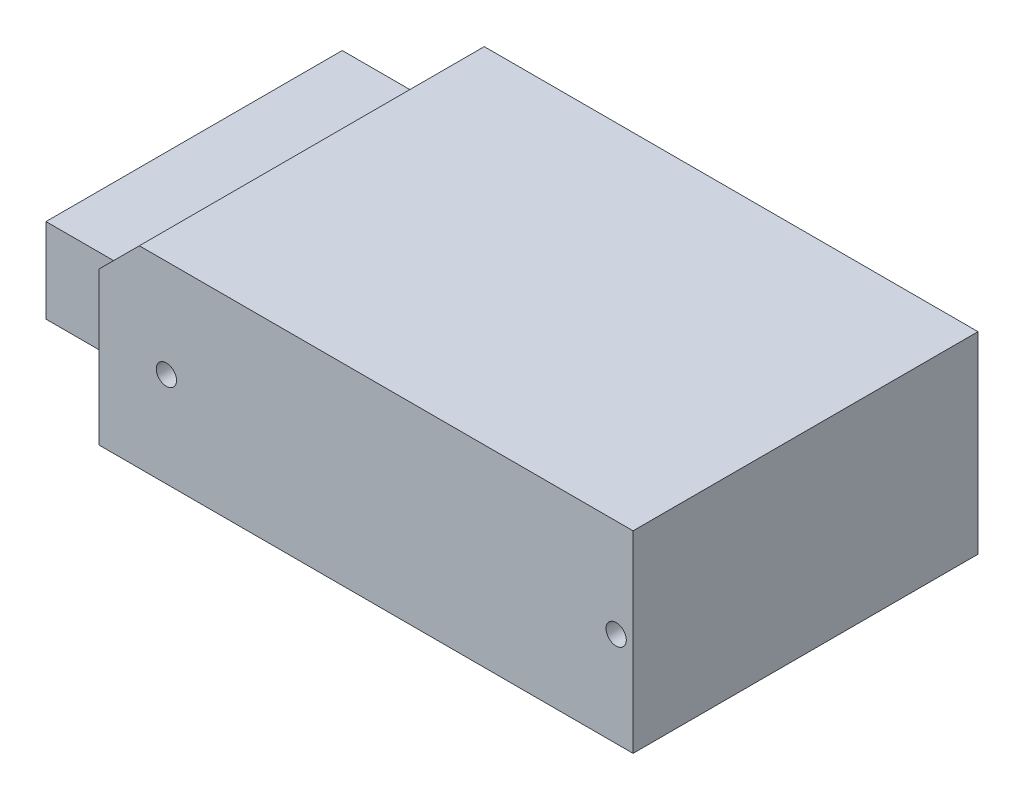
ISO-10303-21;
HEADER;
FILE_DESCRIPTION(('STEP AP214'),'2;1');
FILE_NAME('part.step','',(''),(''),'','','');
FILE_SCHEMA(('AUTOMOTIVE_DESIGN { 1 0 10303 214 1 1 1 1 }'));
ENDSEC;
DATA;
#1=APPLICATION_CONTEXT('core data for automotive mechanical design processes');
#2=APPLICATION_PROTOCOL_DEFINITION('international standard','automotive_design',2000,#1);
#3=PRODUCT_CONTEXT('',#1,'mechanical');
#4=PRODUCT('Part','Part','',(#3));
#5=PRODUCT_RELATED_PRODUCT_CATEGORY('part','',(#4));
#6=PRODUCT_DEFINITION_FORMATION('','',#4);
#7=PRODUCT_DEFINITION_CONTEXT('part definition',#1,'design');
#8=PRODUCT_DEFINITION('design','',#6,#7);
#9=PRODUCT_DEFINITION_SHAPE('','',#8);
#10=(LENGTH_UNIT() NAMED_UNIT(*) SI_UNIT(.MILLI.,.METRE.));
#11=(NAMED_UNIT(*) PLANE_ANGLE_UNIT() SI_UNIT($,.RADIAN.));
#12=(NAMED_UNIT(*) SI_UNIT($,.STERADIAN.) SOLID_ANGLE_UNIT());
#13=UNCERTAINTY_MEASURE_WITH_UNIT(LENGTH_MEASURE(1.E-05),#10,'distance_accuracy_value','');
#14=(GEOMETRIC_REPRESENTATION_CONTEXT(3) GLOBAL_UNCERTAINTY_ASSIGNED_CONTEXT((#13)) GLOBAL_UNIT_ASSIGNED_CONTEXT((#10,
#11,#12)) REPRESENTATION_CONTEXT('',''));
#15=CARTESIAN_POINT('',(0.,0.,0.));
#16=DIRECTION('',(0.,0.,1.));
#17=DIRECTION('',(1.,0.,0.));
#18=AXIS2_PLACEMENT_3D('',#15,#16,#17);
#19=CARTESIAN_POINT('',(-39.5,28.5,25.5));
#20=DIRECTION('',(1.,0.,0.));
#21=DIRECTION('',(0.,0.,-1.));
#22=AXIS2_PLACEMENT_3D('',#19,#20,#21);
#23=PLANE('',#22);
#24=DIRECTION('',(0.,-1.,0.));
#25=VECTOR('',#24,1.);
#26=CARTESIAN_POINT('',(-39.5,28.5,25.5));
#27=LINE('',#26,#25);
#28=CARTESIAN_POINT('',(-39.5,22.5,25.5));
#29=VERTEX_POINT('',#28);
#30=CARTESIAN_POINT('',(-39.5,0.,25.5));
#31=VERTEX_POINT('',#30);
#32=EDGE_CURVE('E113',#29,#31,#27,.T.);
#33=ORIENTED_EDGE('',*,*,#32,.F.);
#34=DIRECTION('',(0.,0.,1.));
#35=VECTOR('',#34,1.);
#36=CARTESIAN_POINT('',(-39.5,22.5,-25.50005));
#37=LINE('',#36,#35);
#38=CARTESIAN_POINT('',(-39.5,22.5,-25.5));
#39=VERTEX_POINT('',#38);
#40=EDGE_CURVE('E103',#39,#29,#37,.T.);
#41=ORIENTED_EDGE('',*,*,#40,.F.);
#42=DIRECTION('',(0.,-1.,0.));
#43=VECTOR('',#42,1.);
#44=CARTESIAN_POINT('',(-39.5,28.5,-25.5));
#45=LINE('',#44,#43);
#46=CARTESIAN_POINT('',(-39.5,17.5,-25.5));
#47=VERTEX_POINT('',#46);
#48=EDGE_CURVE('E37',#39,#47,#45,.T.);
#49=ORIENTED_EDGE('',*,*,#48,.T.);
#50=DIRECTION('',(0.,0.,-1.));
#51=VECTOR('',#50,1.);
#52=CARTESIAN_POINT('',(-39.5,17.5,-25.5));
#53=LINE('',#52,#51);
#54=CARTESIAN_POINT('',(-39.5,17.5,18.3));
#55=VERTEX_POINT('',#54);
#56=EDGE_CURVE('E57',#55,#47,#53,.T.);
#57=ORIENTED_EDGE('',*,*,#56,.F.);
#58=DIRECTION('',(0.,1.,0.));
#59=VECTOR('',#58,1.);
#60=CARTESIAN_POINT('',(-39.5,17.5,18.3));
#61=LINE('',#60,#59);
#62=CARTESIAN_POINT('',(-39.5,5.,18.3));
#63=VERTEX_POINT('',#62);
#64=EDGE_CURVE('E136',#63,#55,#61,.T.);
#65=ORIENTED_EDGE('',*,*,#64,.F.);
#66=DIRECTION('',(0.,0.,1.));
#67=VECTOR('',#66,1.);
#68=CARTESIAN_POINT('',(-39.5,5.,-25.5));
#69=LINE('',#68,#67);
#70=CARTESIAN_POINT('',(-39.5,5.00000000000002,-25.5));
#71=VERTEX_POINT('',#70);
#72=EDGE_CURVE('E133',#71,#63,#69,.T.);
#73=ORIENTED_EDGE('',*,*,#72,.F.);
#74=CARTESIAN_POINT('',(-39.5,0.,-25.5));
#75=VERTEX_POINT('',#74);
#76=EDGE_CURVE('E122',#71,#75,#45,.T.);
#77=ORIENTED_EDGE('',*,*,#76,.T.);
#78=DIRECTION('',(0.,0.,1.));
#79=VECTOR('',#78,1.);
#80=CARTESIAN_POINT('',(-39.5,0.,25.5));
#81=LINE('',#80,#79);
#82=EDGE_CURVE('E120',#75,#31,#81,.T.);
#83=ORIENTED_EDGE('',*,*,#82,.T.);
#84=EDGE_LOOP('',(#33,#41,#49,#57,#65,#73,#77,#83));
#85=FACE_BOUND('',#84,.T.);
#86=ADVANCED_FACE('F33',(#85),#23,.F.);
#87=CARTESIAN_POINT('',(39.5,28.5,25.5));
#88=DIRECTION('',(-1.,0.,0.));
#89=DIRECTION('',(0.,0.,1.));
#90=AXIS2_PLACEMENT_3D('',#87,#88,#89);
#91=PLANE('',#90);
#92=DIRECTION('',(0.,0.,-1.));
#93=VECTOR('',#92,1.);
#94=CARTESIAN_POINT('',(39.5,0.,25.5));
#95=LINE('',#94,#93);
#96=CARTESIAN_POINT('',(39.5,0.,25.5));
#97=VERTEX_POINT('',#96);
#98=CARTESIAN_POINT('',(39.5,0.,-25.5));
#99=VERTEX_POINT('',#98);
#100=EDGE_CURVE('E142',#97,#99,#95,.T.);
#101=ORIENTED_EDGE('',*,*,#100,.T.);
#102=DIRECTION('',(0.,-1.,0.));
#103=VECTOR('',#102,1.);
#104=CARTESIAN_POINT('',(39.5,28.5,-25.5));
#105=LINE('',#104,#103);
#106=CARTESIAN_POINT('',(39.5,28.5,-25.5));
#107=VERTEX_POINT('',#106);
#108=EDGE_CURVE('E43',#107,#99,#105,.T.);
#109=ORIENTED_EDGE('',*,*,#108,.F.);
#110=DIRECTION('',(0.,0.,-1.));
#111=VECTOR('',#110,1.);
#112=CARTESIAN_POINT('',(39.5,28.5,25.5));
#113=LINE('',#112,#111);
#114=CARTESIAN_POINT('',(39.5,28.5,25.5));
#115=VERTEX_POINT('',#114);
#116=EDGE_CURVE('E160',#115,#107,#113,.T.);
#117=ORIENTED_EDGE('',*,*,#116,.F.);
#118=DIRECTION('',(0.,-1.,0.));
#119=VECTOR('',#118,1.);
#120=CARTESIAN_POINT('',(39.5,28.5,25.5));
#121=LINE('',#120,#119);
#122=EDGE_CURVE('E123',#115,#97,#121,.T.);
#123=ORIENTED_EDGE('',*,*,#122,.T.);
#124=EDGE_LOOP('',(#101,#109,#117,#123));
#125=FACE_BOUND('',#124,.T.);
#126=ADVANCED_FACE('F35',(#125),#91,.F.);
#127=CARTESIAN_POINT('',(-39.5,28.5,-25.5));
#128=DIRECTION('',(0.,0.,1.));
#129=DIRECTION('',(1.,0.,0.));
#130=AXIS2_PLACEMENT_3D('',#127,#128,#129);
#131=PLANE('',#130);
#132=ORIENTED_EDGE('',*,*,#48,.F.);
#133=DIRECTION('',(0.707106781186547,0.707106781186548,0.));
#134=VECTOR('',#133,1.);
#135=CARTESIAN_POINT('',(-36.5,25.5,-25.5));
#136=LINE('',#135,#134);
#137=CARTESIAN_POINT('',(-33.5,28.5,-25.5));
#138=VERTEX_POINT('',#137);
#139=EDGE_CURVE('E106',#39,#138,#136,.T.);
#140=ORIENTED_EDGE('',*,*,#139,.T.);
#141=DIRECTION('',(-1.,0.,0.));
#142=VECTOR('',#141,1.);
#143=CARTESIAN_POINT('',(-39.5,28.5,-25.5));
#144=LINE('',#143,#142);
#145=EDGE_CURVE('E163',#107,#138,#144,.T.);
#146=ORIENTED_EDGE('',*,*,#145,.F.);
#147=ORIENTED_EDGE('',*,*,#108,.T.);
#148=DIRECTION('',(-1.,0.,0.));
#149=VECTOR('',#148,1.);
#150=CARTESIAN_POINT('',(-39.5,0.,-25.5));
#151=LINE('',#150,#149);
#152=EDGE_CURVE('E170',#99,#75,#151,.T.);
#153=ORIENTED_EDGE('',*,*,#152,.T.);
#154=ORIENTED_EDGE('',*,*,#76,.F.);
#155=DIRECTION('',(1.,0.,0.));
#156=VECTOR('',#155,1.);
#157=CARTESIAN_POINT('',(-54.5,5.,-25.5));
#158=LINE('',#157,#156);
#159=CARTESIAN_POINT('',(-54.5,5.,-25.5));
#160=VERTEX_POINT('',#159);
#161=EDGE_CURVE('E139',#160,#71,#158,.T.);
#162=ORIENTED_EDGE('',*,*,#161,.F.);
#163=DIRECTION('',(0.,-1.,0.));
#164=VECTOR('',#163,1.);
#165=CARTESIAN_POINT('',(-54.5,17.5,-25.5));
#166=LINE('',#165,#164);
#167=CARTESIAN_POINT('',(-54.5,17.5,-25.5));
#168=VERTEX_POINT('',#167);
#169=EDGE_CURVE('E148',#168,#160,#166,.T.);
#170=ORIENTED_EDGE('',*,*,#169,.F.);
#171=DIRECTION('',(1.,0.,0.));
#172=VECTOR('',#171,1.);
#173=CARTESIAN_POINT('',(-54.5,17.5,-25.5));
#174=LINE('',#173,#172);
#175=EDGE_CURVE('E149',#168,#47,#174,.T.);
#176=ORIENTED_EDGE('',*,*,#175,.T.);
#177=EDGE_LOOP('',(#132,#140,#146,#147,#153,#154,#162,#170,#176));
#178=FACE_BOUND('',#177,.T.);
#179=ADVANCED_FACE('F182',(#178),#131,.F.);
#180=CARTESIAN_POINT('',(-39.5,28.5,25.5));
#181=DIRECTION('',(0.,0.,-1.));
#182=DIRECTION('',(-1.,0.,0.));
#183=AXIS2_PLACEMENT_3D('',#180,#181,#182);
#184=PLANE('',#183);
#185=CARTESIAN_POINT('',(37.,14.,25.5));
#186=DIRECTION('',(0.,0.,1.));
#187=DIRECTION('',(1.,0.,0.));
#188=AXIS2_PLACEMENT_3D('',#185,#186,#187);
#189=CIRCLE('',#188,1.5);
#190=CARTESIAN_POINT('',(38.5,14.,25.5));
#191=VERTEX_POINT('',#190);
#192=EDGE_CURVE('E207',#191,#191,#189,.T.);
#193=ORIENTED_EDGE('',*,*,#192,.F.);
#194=EDGE_LOOP('',(#193));
#195=FACE_BOUND('',#194,.T.);
#196=CARTESIAN_POINT('',(-29.5,14.,25.5));
#197=DIRECTION('',(0.,0.,1.));
#198=DIRECTION('',(1.,0.,0.));
#199=AXIS2_PLACEMENT_3D('',#196,#197,#198);
#200=CIRCLE('',#199,1.5);
#201=CARTESIAN_POINT('',(-28.,14.,25.5));
#202=VERTEX_POINT('',#201);
#203=EDGE_CURVE('E201',#202,#202,#200,.T.);
#204=ORIENTED_EDGE('',*,*,#203,.F.);
#205=EDGE_LOOP('',(#204));
#206=FACE_BOUND('',#205,.T.);
#207=DIRECTION('',(1.,0.,0.));
#208=VECTOR('',#207,1.);
#209=CARTESIAN_POINT('',(-39.5,28.5,25.5));
#210=LINE('',#209,#208);
#211=CARTESIAN_POINT('',(-33.5,28.5,25.5));
#212=VERTEX_POINT('',#211);
#213=EDGE_CURVE('E116',#212,#115,#210,.T.);
#214=ORIENTED_EDGE('',*,*,#213,.F.);
#215=DIRECTION('',(0.707106781186547,0.707106781186548,0.));
#216=VECTOR('',#215,1.);
#217=CARTESIAN_POINT('',(-39.5,22.5,25.5));
#218=LINE('',#217,#216);
#219=EDGE_CURVE('E50',#29,#212,#218,.T.);
#220=ORIENTED_EDGE('',*,*,#219,.F.);
#221=ORIENTED_EDGE('',*,*,#32,.T.);
#222=DIRECTION('',(1.,0.,0.));
#223=VECTOR('',#222,1.);
#224=CARTESIAN_POINT('',(-39.5,0.,25.5));
#225=LINE('',#224,#223);
#226=EDGE_CURVE('E164',#31,#97,#225,.T.);
#227=ORIENTED_EDGE('',*,*,#226,.T.);
#228=ORIENTED_EDGE('',*,*,#122,.F.);
#229=EDGE_LOOP('',(#214,#220,#221,#227,#228));
#230=FACE_BOUND('',#229,.T.);
#231=ADVANCED_FACE('F112',(#195,#206,#230),#184,.F.);
#232=CARTESIAN_POINT('',(39.5,28.5,-25.5));
#233=DIRECTION('',(0.,-1.,0.));
#234=DIRECTION('',(0.,0.,-1.));
#235=AXIS2_PLACEMENT_3D('',#232,#233,#234);
#236=PLANE('',#235);
#237=ORIENTED_EDGE('',*,*,#145,.T.);
#238=DIRECTION('',(0.,0.,1.));
#239=VECTOR('',#238,1.);
#240=CARTESIAN_POINT('',(-33.5,28.5,-25.5));
#241=LINE('',#240,#239);
#242=EDGE_CURVE('E11',#138,#212,#241,.T.);
#243=ORIENTED_EDGE('',*,*,#242,.T.);
#244=ORIENTED_EDGE('',*,*,#213,.T.);
#245=ORIENTED_EDGE('',*,*,#116,.T.);
#246=EDGE_LOOP('',(#237,#243,#244,#245));
#247=FACE_BOUND('',#246,.T.);
#248=ADVANCED_FACE('F237',(#247),#236,.F.);
#249=CARTESIAN_POINT('',(39.5,0.,-25.5));
#250=DIRECTION('',(0.,-1.,0.));
#251=DIRECTION('',(0.,0.,-1.));
#252=AXIS2_PLACEMENT_3D('',#249,#250,#251);
#253=PLANE('',#252);
#254=CARTESIAN_POINT('',(29.,0.,0.));
#255=DIRECTION('',(0.,-1.,0.));
#256=DIRECTION('',(0.,0.,-1.));
#257=AXIS2_PLACEMENT_3D('',#254,#255,#256);
#258=CIRCLE('',#257,1.5);
#259=CARTESIAN_POINT('',(29.,0.,-1.5));
#260=VERTEX_POINT('',#259);
#261=EDGE_CURVE('E219',#260,#260,#258,.T.);
#262=ORIENTED_EDGE('',*,*,#261,.F.);
#263=EDGE_LOOP('',(#262));
#264=FACE_BOUND('',#263,.T.);
#265=CARTESIAN_POINT('',(-26.,0.,0.));
#266=DIRECTION('',(0.,-1.,0.));
#267=DIRECTION('',(0.,0.,-1.));
#268=AXIS2_PLACEMENT_3D('',#265,#266,#267);
#269=CIRCLE('',#268,1.5);
#270=CARTESIAN_POINT('',(-26.,0.,-1.5));
#271=VERTEX_POINT('',#270);
#272=EDGE_CURVE('E213',#271,#271,#269,.T.);
#273=ORIENTED_EDGE('',*,*,#272,.F.);
#274=EDGE_LOOP('',(#273));
#275=FACE_BOUND('',#274,.T.);
#276=ORIENTED_EDGE('',*,*,#100,.F.);
#277=ORIENTED_EDGE('',*,*,#226,.F.);
#278=ORIENTED_EDGE('',*,*,#82,.F.);
#279=ORIENTED_EDGE('',*,*,#152,.F.);
#280=EDGE_LOOP('',(#276,#277,#278,#279));
#281=FACE_BOUND('',#280,.T.);
#282=ADVANCED_FACE('F178',(#264,#275,#281),#253,.T.);
#283=CARTESIAN_POINT('',(-54.5,5.,-25.5));
#284=DIRECTION('',(0.,1.,0.));
#285=DIRECTION('',(0.,0.,1.));
#286=AXIS2_PLACEMENT_3D('',#283,#284,#285);
#287=PLANE('',#286);
#288=ORIENTED_EDGE('',*,*,#72,.T.);
#289=DIRECTION('',(1.,0.,0.));
#290=VECTOR('',#289,1.);
#291=CARTESIAN_POINT('',(-54.5,5.,18.3));
#292=LINE('',#291,#290);
#293=CARTESIAN_POINT('',(-54.5,5.,18.3));
#294=VERTEX_POINT('',#293);
#295=EDGE_CURVE('E143',#294,#63,#292,.T.);
#296=ORIENTED_EDGE('',*,*,#295,.F.);
#297=DIRECTION('',(0.,0.,1.));
#298=VECTOR('',#297,1.);
#299=CARTESIAN_POINT('',(-54.5,5.,-25.5));
#300=LINE('',#299,#298);
#301=EDGE_CURVE('E195',#160,#294,#300,.T.);
#302=ORIENTED_EDGE('',*,*,#301,.F.);
#303=ORIENTED_EDGE('',*,*,#161,.T.);
#304=EDGE_LOOP('',(#288,#296,#302,#303));
#305=FACE_BOUND('',#304,.T.);
#306=ADVANCED_FACE('F236',(#305),#287,.F.);
#307=CARTESIAN_POINT('',(-54.5,17.5,18.3));
#308=DIRECTION('',(0.,0.,-1.));
#309=DIRECTION('',(-1.,0.,0.));
#310=AXIS2_PLACEMENT_3D('',#307,#308,#309);
#311=PLANE('',#310);
#312=ORIENTED_EDGE('',*,*,#64,.T.);
#313=DIRECTION('',(1.,0.,0.));
#314=VECTOR('',#313,1.);
#315=CARTESIAN_POINT('',(-54.5,17.5,18.3));
#316=LINE('',#315,#314);
#317=CARTESIAN_POINT('',(-54.5,17.5,18.3));
#318=VERTEX_POINT('',#317);
#319=EDGE_CURVE('E155',#318,#55,#316,.T.);
#320=ORIENTED_EDGE('',*,*,#319,.F.);
#321=DIRECTION('',(0.,1.,0.));
#322=VECTOR('',#321,1.);
#323=CARTESIAN_POINT('',(-54.5,17.5,18.3));
#324=LINE('',#323,#322);
#325=EDGE_CURVE('E193',#294,#318,#324,.T.);
#326=ORIENTED_EDGE('',*,*,#325,.F.);
#327=ORIENTED_EDGE('',*,*,#295,.T.);
#328=EDGE_LOOP('',(#312,#320,#326,#327));
#329=FACE_BOUND('',#328,.T.);
#330=ADVANCED_FACE('F298',(#329),#311,.F.);
#331=CARTESIAN_POINT('',(-54.5,17.5,-25.5));
#332=DIRECTION('',(0.,-1.,0.));
#333=DIRECTION('',(0.,0.,-1.));
#334=AXIS2_PLACEMENT_3D('',#331,#332,#333);
#335=PLANE('',#334);
#336=ORIENTED_EDGE('',*,*,#56,.T.);
#337=ORIENTED_EDGE('',*,*,#175,.F.);
#338=DIRECTION('',(0.,0.,-1.));
#339=VECTOR('',#338,1.);
#340=CARTESIAN_POINT('',(-54.5,17.5,-25.5));
#341=LINE('',#340,#339);
#342=EDGE_CURVE('E192',#318,#168,#341,.T.);
#343=ORIENTED_EDGE('',*,*,#342,.F.);
#344=ORIENTED_EDGE('',*,*,#319,.T.);
#345=EDGE_LOOP('',(#336,#337,#343,#344));
#346=FACE_BOUND('',#345,.T.);
#347=ADVANCED_FACE('F186',(#346),#335,.F.);
#348=CARTESIAN_POINT('',(-54.5,5.,-25.5));
#349=DIRECTION('',(-1.,0.,0.));
#350=DIRECTION('',(0.,0.,1.));
#351=AXIS2_PLACEMENT_3D('',#348,#349,#350);
#352=PLANE('',#351);
#353=ORIENTED_EDGE('',*,*,#169,.T.);
#354=ORIENTED_EDGE('',*,*,#301,.T.);
#355=ORIENTED_EDGE('',*,*,#325,.T.);
#356=ORIENTED_EDGE('',*,*,#342,.T.);
#357=EDGE_LOOP('',(#353,#354,#355,#356));
#358=FACE_BOUND('',#357,.T.);
#359=ADVANCED_FACE('F289',(#358),#352,.T.);
#360=CARTESIAN_POINT('',(-39.5,22.5,-25.50005));
#361=DIRECTION('',(0.707106781186548,-0.707106781186547,0.));
#362=DIRECTION('',(0.707106781186547,0.707106781186548,0.));
#363=AXIS2_PLACEMENT_3D('',#360,#361,#362);
#364=PLANE('',#363);
#365=ORIENTED_EDGE('',*,*,#40,.T.);
#366=ORIENTED_EDGE('',*,*,#219,.T.);
#367=ORIENTED_EDGE('',*,*,#242,.F.);
#368=ORIENTED_EDGE('',*,*,#139,.F.);
#369=EDGE_LOOP('',(#365,#366,#367,#368));
#370=FACE_BOUND('',#369,.T.);
#371=ADVANCED_FACE('F104',(#370),#364,.F.);
#372=CARTESIAN_POINT('',(-29.5,14.,10.5));
#373=DIRECTION('',(0.,0.,1.));
#374=DIRECTION('',(1.,0.,0.));
#375=AXIS2_PLACEMENT_3D('',#372,#373,#374);
#376=CYLINDRICAL_SURFACE('',#375,1.5);
#377=CARTESIAN_POINT('',(-29.5,14.,10.5));
#378=DIRECTION('',(0.,0.,1.));
#379=DIRECTION('',(1.,0.,0.));
#380=AXIS2_PLACEMENT_3D('',#377,#378,#379);
#381=CIRCLE('',#380,1.5);
#382=CARTESIAN_POINT('',(-28.,14.,10.5));
#383=VERTEX_POINT('',#382);
#384=EDGE_CURVE('E117',#383,#383,#381,.T.);
#385=ORIENTED_EDGE('',*,*,#384,.F.);
#386=EDGE_LOOP('',(#385));
#387=FACE_BOUND('',#386,.T.);
#388=ORIENTED_EDGE('',*,*,#203,.T.);
#389=EDGE_LOOP('',(#388));
#390=FACE_BOUND('',#389,.T.);
#391=ADVANCED_FACE('F279',(#387,#390),#376,.F.);
#392=CARTESIAN_POINT('',(-29.5,14.,10.5));
#393=DIRECTION('',(0.,0.,1.));
#394=DIRECTION('',(1.,0.,0.));
#395=AXIS2_PLACEMENT_3D('',#392,#393,#394);
#396=PLANE('',#395);
#397=ORIENTED_EDGE('',*,*,#384,.T.);
#398=EDGE_LOOP('',(#397));
#399=FACE_BOUND('',#398,.T.);
#400=ADVANCED_FACE('F281',(#399),#396,.T.);
#401=CARTESIAN_POINT('',(37.,14.,10.5));
#402=DIRECTION('',(0.,0.,1.));
#403=DIRECTION('',(1.,0.,0.));
#404=AXIS2_PLACEMENT_3D('',#401,#402,#403);
#405=CYLINDRICAL_SURFACE('',#404,1.5);
#406=CARTESIAN_POINT('',(37.,14.,10.5));
#407=DIRECTION('',(0.,0.,1.));
#408=DIRECTION('',(1.,0.,0.));
#409=AXIS2_PLACEMENT_3D('',#406,#407,#408);
#410=CIRCLE('',#409,1.5);
#411=CARTESIAN_POINT('',(38.5,14.,10.5));
#412=VERTEX_POINT('',#411);
#413=EDGE_CURVE('E204',#412,#412,#410,.T.);
#414=ORIENTED_EDGE('',*,*,#413,.F.);
#415=EDGE_LOOP('',(#414));
#416=FACE_BOUND('',#415,.T.);
#417=ORIENTED_EDGE('',*,*,#192,.T.);
#418=EDGE_LOOP('',(#417));
#419=FACE_BOUND('',#418,.T.);
#420=ADVANCED_FACE('F252',(#416,#419),#405,.F.);
#421=CARTESIAN_POINT('',(37.,14.,10.5));
#422=DIRECTION('',(0.,0.,1.));
#423=DIRECTION('',(1.,0.,0.));
#424=AXIS2_PLACEMENT_3D('',#421,#422,#423);
#425=PLANE('',#424);
#426=ORIENTED_EDGE('',*,*,#413,.T.);
#427=EDGE_LOOP('',(#426));
#428=FACE_BOUND('',#427,.T.);
#429=ADVANCED_FACE('F243',(#428),#425,.T.);
#430=CARTESIAN_POINT('',(-26.,15.,0.));
#431=DIRECTION('',(0.,-1.,0.));
#432=DIRECTION('',(0.,0.,-1.));
#433=AXIS2_PLACEMENT_3D('',#430,#431,#432);
#434=CYLINDRICAL_SURFACE('',#433,1.5);
#435=CARTESIAN_POINT('',(-26.,15.,0.));
#436=DIRECTION('',(0.,-1.,0.));
#437=DIRECTION('',(0.,0.,-1.));
#438=AXIS2_PLACEMENT_3D('',#435,#436,#437);
#439=CIRCLE('',#438,1.5);
#440=CARTESIAN_POINT('',(-26.,15.,-1.5));
#441=VERTEX_POINT('',#440);
#442=EDGE_CURVE('E210',#441,#441,#439,.T.);
#443=ORIENTED_EDGE('',*,*,#442,.F.);
#444=EDGE_LOOP('',(#443));
#445=FACE_BOUND('',#444,.T.);
#446=ORIENTED_EDGE('',*,*,#272,.T.);
#447=EDGE_LOOP('',(#446));
#448=FACE_BOUND('',#447,.T.);
#449=ADVANCED_FACE('F241',(#445,#448),#434,.F.);
#450=CARTESIAN_POINT('',(-26.,15.,0.));
#451=DIRECTION('',(0.,-1.,0.));
#452=DIRECTION('',(0.,0.,-1.));
#453=AXIS2_PLACEMENT_3D('',#450,#451,#452);
#454=PLANE('',#453);
#455=ORIENTED_EDGE('',*,*,#442,.T.);
#456=EDGE_LOOP('',(#455));
#457=FACE_BOUND('',#456,.T.);
#458=ADVANCED_FACE('F230',(#457),#454,.T.);
#459=CARTESIAN_POINT('',(29.,15.,0.));
#460=DIRECTION('',(0.,-1.,0.));
#461=DIRECTION('',(0.,0.,-1.));
#462=AXIS2_PLACEMENT_3D('',#459,#460,#461);
#463=CYLINDRICAL_SURFACE('',#462,1.5);
#464=CARTESIAN_POINT('',(29.,15.,0.));
#465=DIRECTION('',(0.,-1.,0.));
#466=DIRECTION('',(0.,0.,-1.));
#467=AXIS2_PLACEMENT_3D('',#464,#465,#466);
#468=CIRCLE('',#467,1.5);
#469=CARTESIAN_POINT('',(29.,15.,-1.5));
#470=VERTEX_POINT('',#469);
#471=EDGE_CURVE('E216',#470,#470,#468,.T.);
#472=ORIENTED_EDGE('',*,*,#471,.F.);
#473=EDGE_LOOP('',(#472));
#474=FACE_BOUND('',#473,.T.);
#475=ORIENTED_EDGE('',*,*,#261,.T.);
#476=EDGE_LOOP('',(#475));
#477=FACE_BOUND('',#476,.T.);
#478=ADVANCED_FACE('F227',(#474,#477),#463,.F.);
#479=CARTESIAN_POINT('',(29.,15.,0.));
#480=DIRECTION('',(0.,-1.,0.));
#481=DIRECTION('',(0.,0.,-1.));
#482=AXIS2_PLACEMENT_3D('',#479,#480,#481);
#483=PLANE('',#482);
#484=ORIENTED_EDGE('',*,*,#471,.T.);
#485=EDGE_LOOP('',(#484));
#486=FACE_BOUND('',#485,.T.);
#487=ADVANCED_FACE('F225',(#486),#483,.T.);
#488=CLOSED_SHELL('',(#86,#126,#179,#231,#248,#282,#306,#330,#347,#359,#371,#391,#400,#420,#429,
#449,#458,#478,#487));
#489=MANIFOLD_SOLID_BREP('B2',#488);
#490=ADVANCED_BREP_SHAPE_REPRESENTATION('',(#18,#489),#14);
#491=SHAPE_DEFINITION_REPRESENTATION(#9,#490);
ENDSEC;
END-ISO-10303-21;
